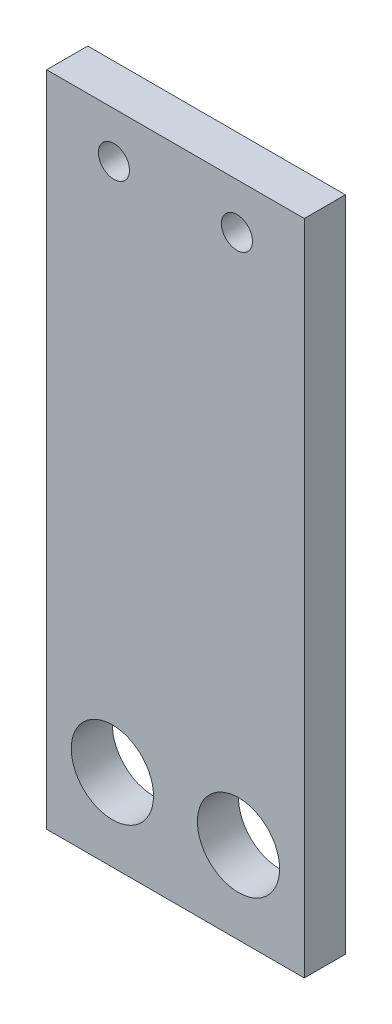
ISO-10303-21;
HEADER;
FILE_DESCRIPTION(('STEP AP214'),'2;1');
FILE_NAME('part.step','',(''),(''),'','','');
FILE_SCHEMA(('AUTOMOTIVE_DESIGN { 1 0 10303 214 1 1 1 1 }'));
ENDSEC;
DATA;
#1=APPLICATION_CONTEXT('core data for automotive mechanical design processes');
#2=APPLICATION_PROTOCOL_DEFINITION('international standard','automotive_design',2000,#1);
#3=PRODUCT_CONTEXT('',#1,'mechanical');
#4=PRODUCT('Part','Part','',(#3));
#5=PRODUCT_RELATED_PRODUCT_CATEGORY('part','',(#4));
#6=PRODUCT_DEFINITION_FORMATION('','',#4);
#7=PRODUCT_DEFINITION_CONTEXT('part definition',#1,'design');
#8=PRODUCT_DEFINITION('design','',#6,#7);
#9=PRODUCT_DEFINITION_SHAPE('','',#8);
#10=(LENGTH_UNIT() NAMED_UNIT(*) SI_UNIT(.MILLI.,.METRE.));
#11=(NAMED_UNIT(*) PLANE_ANGLE_UNIT() SI_UNIT($,.RADIAN.));
#12=(NAMED_UNIT(*) SI_UNIT($,.STERADIAN.) SOLID_ANGLE_UNIT());
#13=UNCERTAINTY_MEASURE_WITH_UNIT(LENGTH_MEASURE(1.E-05),#10,'distance_accuracy_value','');
#14=(GEOMETRIC_REPRESENTATION_CONTEXT(3) GLOBAL_UNCERTAINTY_ASSIGNED_CONTEXT((#13)) GLOBAL_UNIT_ASSIGNED_CONTEXT((#10,
#11,#12)) REPRESENTATION_CONTEXT('',''));
#15=CARTESIAN_POINT('',(0.,0.,0.));
#16=DIRECTION('',(0.,0.,1.));
#17=DIRECTION('',(1.,0.,0.));
#18=AXIS2_PLACEMENT_3D('',#15,#16,#17);
#19=CARTESIAN_POINT('',(0.,0.,3.175));
#20=DIRECTION('',(0.,0.,1.));
#21=DIRECTION('',(1.,0.,0.));
#22=AXIS2_PLACEMENT_3D('',#19,#20,#21);
#23=PLANE('',#22);
#24=CARTESIAN_POINT('',(-3.96597186213208,-28.7462383712063,3.175));
#25=DIRECTION('',(0.,0.,1.));
#26=DIRECTION('',(1.,0.,0.));
#27=AXIS2_PLACEMENT_3D('',#24,#25,#26);
#28=CIRCLE('',#27,3.175);
#29=CARTESIAN_POINT('',(-0.790971862132075,-28.7462383712063,3.175));
#30=VERTEX_POINT('',#29);
#31=EDGE_CURVE('E146',#30,#30,#28,.T.);
#32=ORIENTED_EDGE('',*,*,#31,.F.);
#33=EDGE_LOOP('',(#32));
#34=FACE_BOUND('',#33,.T.);
#35=CARTESIAN_POINT('',(-3.84597186213208,12.1721041198063,3.175));
#36=DIRECTION('',(0.,0.,1.));
#37=DIRECTION('',(1.,0.,0.));
#38=AXIS2_PLACEMENT_3D('',#35,#36,#37);
#39=CIRCLE('',#38,1.2);
#40=CARTESIAN_POINT('',(-2.64597186213208,12.1721041198063,3.175));
#41=VERTEX_POINT('',#40);
#42=EDGE_CURVE('E116',#41,#41,#39,.T.);
#43=ORIENTED_EDGE('',*,*,#42,.F.);
#44=EDGE_LOOP('',(#43));
#45=FACE_BOUND('',#44,.T.);
#46=DIRECTION('',(0.,-1.,0.));
#47=VECTOR('',#46,1.);
#48=CARTESIAN_POINT('',(-9.04597186213208,15.7037616287937,3.175));
#49=LINE('',#48,#47);
#50=CARTESIAN_POINT('',(-9.04597186213208,15.7037616287937,3.175));
#51=VERTEX_POINT('',#50);
#52=CARTESIAN_POINT('',(-9.04597186213207,-35.0962383712063,3.175));
#53=VERTEX_POINT('',#52);
#54=EDGE_CURVE('E96',#51,#53,#49,.T.);
#55=ORIENTED_EDGE('',*,*,#54,.T.);
#56=DIRECTION('',(1.,0.,0.));
#57=VECTOR('',#56,1.);
#58=CARTESIAN_POINT('',(-9.04597186213207,-35.0962383712063,3.175));
#59=LINE('',#58,#57);
#60=CARTESIAN_POINT('',(10.8540281378679,-35.0962383712063,3.175));
#61=VERTEX_POINT('',#60);
#62=EDGE_CURVE('E91',#53,#61,#59,.T.);
#63=ORIENTED_EDGE('',*,*,#62,.T.);
#64=DIRECTION('',(0.,1.,0.));
#65=VECTOR('',#64,1.);
#66=CARTESIAN_POINT('',(10.8540281378679,15.7037616287937,3.175));
#67=LINE('',#66,#65);
#68=CARTESIAN_POINT('',(10.8540281378679,15.7037616287937,3.175));
#69=VERTEX_POINT('',#68);
#70=EDGE_CURVE('E94',#61,#69,#67,.T.);
#71=ORIENTED_EDGE('',*,*,#70,.T.);
#72=DIRECTION('',(-1.,0.,0.));
#73=VECTOR('',#72,1.);
#74=CARTESIAN_POINT('',(-9.04597186213208,15.7037616287937,3.175));
#75=LINE('',#74,#73);
#76=EDGE_CURVE('E61',#69,#51,#75,.T.);
#77=ORIENTED_EDGE('',*,*,#76,.T.);
#78=EDGE_LOOP('',(#55,#63,#71,#77));
#79=FACE_BOUND('',#78,.T.);
#80=CARTESIAN_POINT('',(5.65402813786792,12.1721041198063,3.175));
#81=DIRECTION('',(0.,0.,1.));
#82=DIRECTION('',(1.,0.,0.));
#83=AXIS2_PLACEMENT_3D('',#80,#81,#82);
#84=CIRCLE('',#83,1.2);
#85=CARTESIAN_POINT('',(6.85402813786792,12.1721041198063,3.175));
#86=VERTEX_POINT('',#85);
#87=EDGE_CURVE('E138',#86,#86,#84,.T.);
#88=ORIENTED_EDGE('',*,*,#87,.F.);
#89=EDGE_LOOP('',(#88));
#90=FACE_BOUND('',#89,.T.);
#91=CARTESIAN_POINT('',(5.77402813786792,-28.7462383712063,3.175));
#92=DIRECTION('',(0.,0.,1.));
#93=DIRECTION('',(1.,0.,0.));
#94=AXIS2_PLACEMENT_3D('',#91,#92,#93);
#95=CIRCLE('',#94,3.175);
#96=CARTESIAN_POINT('',(8.94902813786792,-28.7462383712063,3.175));
#97=VERTEX_POINT('',#96);
#98=EDGE_CURVE('E154',#97,#97,#95,.T.);
#99=ORIENTED_EDGE('',*,*,#98,.F.);
#100=EDGE_LOOP('',(#99));
#101=FACE_BOUND('',#100,.T.);
#102=ADVANCED_FACE('F43',(#34,#45,#79,#90,#101),#23,.T.);
#103=CARTESIAN_POINT('',(0.,0.,0.));
#104=DIRECTION('',(0.,0.,1.));
#105=DIRECTION('',(1.,0.,0.));
#106=AXIS2_PLACEMENT_3D('',#103,#104,#105);
#107=PLANE('',#106);
#108=DIRECTION('',(0.,-1.,0.));
#109=VECTOR('',#108,1.);
#110=CARTESIAN_POINT('',(-9.04597186213208,15.7037616287937,0.));
#111=LINE('',#110,#109);
#112=CARTESIAN_POINT('',(-9.04597186213208,15.7037616287937,0.));
#113=VERTEX_POINT('',#112);
#114=CARTESIAN_POINT('',(-9.04597186213207,-35.0962383712063,0.));
#115=VERTEX_POINT('',#114);
#116=EDGE_CURVE('E112',#113,#115,#111,.T.);
#117=ORIENTED_EDGE('',*,*,#116,.F.);
#118=DIRECTION('',(-1.,0.,0.));
#119=VECTOR('',#118,1.);
#120=CARTESIAN_POINT('',(-9.04597186213208,15.7037616287937,0.));
#121=LINE('',#120,#119);
#122=CARTESIAN_POINT('',(10.8540281378679,15.7037616287937,0.));
#123=VERTEX_POINT('',#122);
#124=EDGE_CURVE('E84',#123,#113,#121,.T.);
#125=ORIENTED_EDGE('',*,*,#124,.F.);
#126=DIRECTION('',(0.,1.,0.));
#127=VECTOR('',#126,1.);
#128=CARTESIAN_POINT('',(10.8540281378679,15.7037616287937,0.));
#129=LINE('',#128,#127);
#130=CARTESIAN_POINT('',(10.8540281378679,-35.0962383712063,0.));
#131=VERTEX_POINT('',#130);
#132=EDGE_CURVE('E78',#131,#123,#129,.T.);
#133=ORIENTED_EDGE('',*,*,#132,.F.);
#134=DIRECTION('',(1.,0.,0.));
#135=VECTOR('',#134,1.);
#136=CARTESIAN_POINT('',(-9.04597186213207,-35.0962383712063,0.));
#137=LINE('',#136,#135);
#138=EDGE_CURVE('E101',#115,#131,#137,.T.);
#139=ORIENTED_EDGE('',*,*,#138,.F.);
#140=EDGE_LOOP('',(#117,#125,#133,#139));
#141=FACE_BOUND('',#140,.T.);
#142=CARTESIAN_POINT('',(-3.84597186213208,12.1721041198063,0.));
#143=DIRECTION('',(0.,0.,1.));
#144=DIRECTION('',(1.,0.,0.));
#145=AXIS2_PLACEMENT_3D('',#142,#143,#144);
#146=CIRCLE('',#145,1.2);
#147=CARTESIAN_POINT('',(-2.64597186213208,12.1721041198063,0.));
#148=VERTEX_POINT('',#147);
#149=EDGE_CURVE('E134',#148,#148,#146,.T.);
#150=ORIENTED_EDGE('',*,*,#149,.T.);
#151=EDGE_LOOP('',(#150));
#152=FACE_BOUND('',#151,.T.);
#153=CARTESIAN_POINT('',(5.65402813786792,12.1721041198063,0.));
#154=DIRECTION('',(0.,0.,1.));
#155=DIRECTION('',(1.,0.,0.));
#156=AXIS2_PLACEMENT_3D('',#153,#154,#155);
#157=CIRCLE('',#156,1.2);
#158=CARTESIAN_POINT('',(6.85402813786792,12.1721041198063,0.));
#159=VERTEX_POINT('',#158);
#160=EDGE_CURVE('E142',#159,#159,#157,.T.);
#161=ORIENTED_EDGE('',*,*,#160,.T.);
#162=EDGE_LOOP('',(#161));
#163=FACE_BOUND('',#162,.T.);
#164=CARTESIAN_POINT('',(-3.96597186213208,-28.7462383712063,0.));
#165=DIRECTION('',(0.,0.,1.));
#166=DIRECTION('',(1.,0.,0.));
#167=AXIS2_PLACEMENT_3D('',#164,#165,#166);
#168=CIRCLE('',#167,3.175);
#169=CARTESIAN_POINT('',(-0.790971862132075,-28.7462383712063,0.));
#170=VERTEX_POINT('',#169);
#171=EDGE_CURVE('E150',#170,#170,#168,.T.);
#172=ORIENTED_EDGE('',*,*,#171,.T.);
#173=EDGE_LOOP('',(#172));
#174=FACE_BOUND('',#173,.T.);
#175=CARTESIAN_POINT('',(5.77402813786792,-28.7462383712063,0.));
#176=DIRECTION('',(0.,0.,1.));
#177=DIRECTION('',(1.,0.,0.));
#178=AXIS2_PLACEMENT_3D('',#175,#176,#177);
#179=CIRCLE('',#178,3.175);
#180=CARTESIAN_POINT('',(8.94902813786792,-28.7462383712063,0.));
#181=VERTEX_POINT('',#180);
#182=EDGE_CURVE('E158',#181,#181,#179,.T.);
#183=ORIENTED_EDGE('',*,*,#182,.T.);
#184=EDGE_LOOP('',(#183));
#185=FACE_BOUND('',#184,.T.);
#186=ADVANCED_FACE('F129',(#141,#152,#163,#174,#185),#107,.F.);
#187=CARTESIAN_POINT('',(-9.04597186213208,15.7037616287937,3.175));
#188=DIRECTION('',(1.,0.,0.));
#189=DIRECTION('',(0.,1.,0.));
#190=AXIS2_PLACEMENT_3D('',#187,#188,#189);
#191=PLANE('',#190);
#192=ORIENTED_EDGE('',*,*,#116,.T.);
#193=DIRECTION('',(0.,0.,-1.));
#194=VECTOR('',#193,1.);
#195=CARTESIAN_POINT('',(-9.04597186213207,-35.0962383712063,3.175));
#196=LINE('',#195,#194);
#197=EDGE_CURVE('E11',#53,#115,#196,.T.);
#198=ORIENTED_EDGE('',*,*,#197,.F.);
#199=ORIENTED_EDGE('',*,*,#54,.F.);
#200=DIRECTION('',(0.,0.,-1.));
#201=VECTOR('',#200,1.);
#202=CARTESIAN_POINT('',(-9.04597186213208,15.7037616287937,3.175));
#203=LINE('',#202,#201);
#204=EDGE_CURVE('E108',#51,#113,#203,.T.);
#205=ORIENTED_EDGE('',*,*,#204,.T.);
#206=EDGE_LOOP('',(#192,#198,#199,#205));
#207=FACE_BOUND('',#206,.T.);
#208=ADVANCED_FACE('F45',(#207),#191,.F.);
#209=CARTESIAN_POINT('',(-9.04597186213207,-35.0962383712063,3.175));
#210=DIRECTION('',(0.,1.,0.));
#211=DIRECTION('',(0.,0.,1.));
#212=AXIS2_PLACEMENT_3D('',#209,#210,#211);
#213=PLANE('',#212);
#214=ORIENTED_EDGE('',*,*,#138,.T.);
#215=DIRECTION('',(0.,0.,-1.));
#216=VECTOR('',#215,1.);
#217=CARTESIAN_POINT('',(10.8540281378679,-35.0962383712063,3.175));
#218=LINE('',#217,#216);
#219=EDGE_CURVE('E53',#61,#131,#218,.T.);
#220=ORIENTED_EDGE('',*,*,#219,.F.);
#221=ORIENTED_EDGE('',*,*,#62,.F.);
#222=ORIENTED_EDGE('',*,*,#197,.T.);
#223=EDGE_LOOP('',(#214,#220,#221,#222));
#224=FACE_BOUND('',#223,.T.);
#225=ADVANCED_FACE('F100',(#224),#213,.F.);
#226=CARTESIAN_POINT('',(10.8540281378679,15.7037616287937,3.175));
#227=DIRECTION('',(-1.,0.,0.));
#228=DIRECTION('',(0.,-1.,0.));
#229=AXIS2_PLACEMENT_3D('',#226,#227,#228);
#230=PLANE('',#229);
#231=ORIENTED_EDGE('',*,*,#132,.T.);
#232=DIRECTION('',(0.,0.,-1.));
#233=VECTOR('',#232,1.);
#234=CARTESIAN_POINT('',(10.8540281378679,15.7037616287937,3.175));
#235=LINE('',#234,#233);
#236=EDGE_CURVE('E103',#69,#123,#235,.T.);
#237=ORIENTED_EDGE('',*,*,#236,.F.);
#238=ORIENTED_EDGE('',*,*,#70,.F.);
#239=ORIENTED_EDGE('',*,*,#219,.T.);
#240=EDGE_LOOP('',(#231,#237,#238,#239));
#241=FACE_BOUND('',#240,.T.);
#242=ADVANCED_FACE('F104',(#241),#230,.F.);
#243=CARTESIAN_POINT('',(-9.04597186213208,15.7037616287937,3.175));
#244=DIRECTION('',(0.,-1.,0.));
#245=DIRECTION('',(0.,0.,-1.));
#246=AXIS2_PLACEMENT_3D('',#243,#244,#245);
#247=PLANE('',#246);
#248=ORIENTED_EDGE('',*,*,#124,.T.);
#249=ORIENTED_EDGE('',*,*,#204,.F.);
#250=ORIENTED_EDGE('',*,*,#76,.F.);
#251=ORIENTED_EDGE('',*,*,#236,.T.);
#252=EDGE_LOOP('',(#248,#249,#250,#251));
#253=FACE_BOUND('',#252,.T.);
#254=ADVANCED_FACE('F126',(#253),#247,.F.);
#255=CARTESIAN_POINT('',(-3.84597186213208,12.1721041198063,3.175));
#256=DIRECTION('',(0.,0.,-1.));
#257=DIRECTION('',(-1.,0.,0.));
#258=AXIS2_PLACEMENT_3D('',#255,#256,#257);
#259=CYLINDRICAL_SURFACE('',#258,1.2);
#260=ORIENTED_EDGE('',*,*,#42,.T.);
#261=EDGE_LOOP('',(#260));
#262=FACE_BOUND('',#261,.T.);
#263=ORIENTED_EDGE('',*,*,#149,.F.);
#264=EDGE_LOOP('',(#263));
#265=FACE_BOUND('',#264,.T.);
#266=ADVANCED_FACE('F179',(#262,#265),#259,.F.);
#267=CARTESIAN_POINT('',(5.65402813786792,12.1721041198063,3.175));
#268=DIRECTION('',(0.,0.,-1.));
#269=DIRECTION('',(-1.,0.,0.));
#270=AXIS2_PLACEMENT_3D('',#267,#268,#269);
#271=CYLINDRICAL_SURFACE('',#270,1.2);
#272=ORIENTED_EDGE('',*,*,#87,.T.);
#273=EDGE_LOOP('',(#272));
#274=FACE_BOUND('',#273,.T.);
#275=ORIENTED_EDGE('',*,*,#160,.F.);
#276=EDGE_LOOP('',(#275));
#277=FACE_BOUND('',#276,.T.);
#278=ADVANCED_FACE('F233',(#274,#277),#271,.F.);
#279=CARTESIAN_POINT('',(-3.96597186213208,-28.7462383712063,3.175));
#280=DIRECTION('',(0.,0.,-1.));
#281=DIRECTION('',(-1.,0.,0.));
#282=AXIS2_PLACEMENT_3D('',#279,#280,#281);
#283=CYLINDRICAL_SURFACE('',#282,3.175);
#284=ORIENTED_EDGE('',*,*,#31,.T.);
#285=EDGE_LOOP('',(#284));
#286=FACE_BOUND('',#285,.T.);
#287=ORIENTED_EDGE('',*,*,#171,.F.);
#288=EDGE_LOOP('',(#287));
#289=FACE_BOUND('',#288,.T.);
#290=ADVANCED_FACE('F242',(#286,#289),#283,.F.);
#291=CARTESIAN_POINT('',(5.77402813786792,-28.7462383712063,3.175));
#292=DIRECTION('',(0.,0.,-1.));
#293=DIRECTION('',(-1.,0.,0.));
#294=AXIS2_PLACEMENT_3D('',#291,#292,#293);
#295=CYLINDRICAL_SURFACE('',#294,3.175);
#296=ORIENTED_EDGE('',*,*,#98,.T.);
#297=EDGE_LOOP('',(#296));
#298=FACE_BOUND('',#297,.T.);
#299=ORIENTED_EDGE('',*,*,#182,.F.);
#300=EDGE_LOOP('',(#299));
#301=FACE_BOUND('',#300,.T.);
#302=ADVANCED_FACE('F166',(#298,#301),#295,.F.);
#303=CLOSED_SHELL('',(#102,#186,#208,#225,#242,#254,#266,#278,#290,#302));
#304=MANIFOLD_SOLID_BREP('B2',#303);
#305=ADVANCED_BREP_SHAPE_REPRESENTATION('',(#18,#304),#14);
#306=SHAPE_DEFINITION_REPRESENTATION(#9,#305);
ENDSEC;
END-ISO-10303-21;
